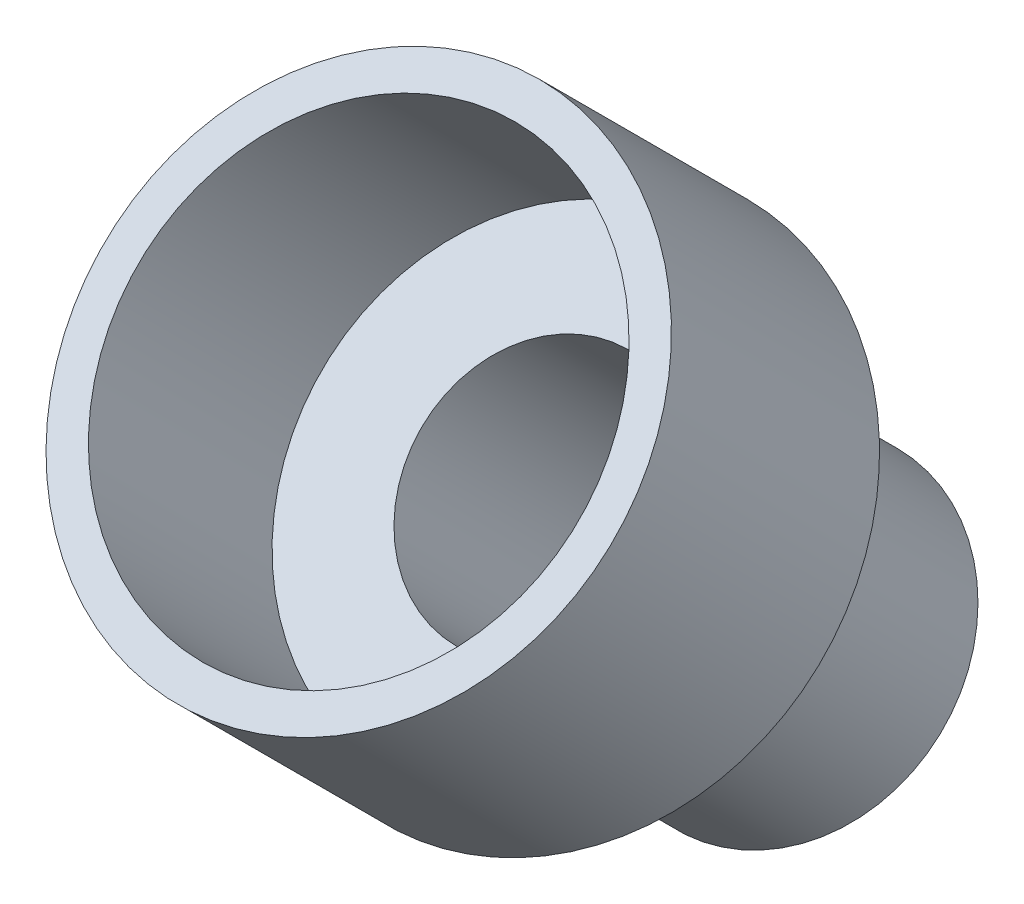
ISO-10303-21;
HEADER;
FILE_DESCRIPTION(('STEP AP214'),'2;1');
FILE_NAME('part.step','',(''),(''),'','','');
FILE_SCHEMA(('AUTOMOTIVE_DESIGN { 1 0 10303 214 1 1 1 1 }'));
ENDSEC;
DATA;
#1=APPLICATION_CONTEXT('core data for automotive mechanical design processes');
#2=APPLICATION_PROTOCOL_DEFINITION('international standard','automotive_design',2000,#1);
#3=PRODUCT_CONTEXT('',#1,'mechanical');
#4=PRODUCT('Part','Part','',(#3));
#5=PRODUCT_RELATED_PRODUCT_CATEGORY('part','',(#4));
#6=PRODUCT_DEFINITION_FORMATION('','',#4);
#7=PRODUCT_DEFINITION_CONTEXT('part definition',#1,'design');
#8=PRODUCT_DEFINITION('design','',#6,#7);
#9=PRODUCT_DEFINITION_SHAPE('','',#8);
#10=(LENGTH_UNIT() NAMED_UNIT(*) SI_UNIT(.MILLI.,.METRE.));
#11=(NAMED_UNIT(*) PLANE_ANGLE_UNIT() SI_UNIT($,.RADIAN.));
#12=(NAMED_UNIT(*) SI_UNIT($,.STERADIAN.) SOLID_ANGLE_UNIT());
#13=UNCERTAINTY_MEASURE_WITH_UNIT(LENGTH_MEASURE(1.E-05),#10,'distance_accuracy_value','');
#14=(GEOMETRIC_REPRESENTATION_CONTEXT(3) GLOBAL_UNCERTAINTY_ASSIGNED_CONTEXT((#13)) GLOBAL_UNIT_ASSIGNED_CONTEXT((#10,
#11,#12)) REPRESENTATION_CONTEXT('',''));
#15=CARTESIAN_POINT('',(0.,0.,0.));
#16=DIRECTION('',(0.,0.,1.));
#17=DIRECTION('',(1.,0.,0.));
#18=AXIS2_PLACEMENT_3D('',#15,#16,#17);
#19=CARTESIAN_POINT('',(0.,125.566457335286,51.4420183313214));
#20=DIRECTION('',(0.,-0.707106781186546,-0.707106781186549));
#21=DIRECTION('',(0.,0.707106781186549,-0.707106781186546));
#22=AXIS2_PLACEMENT_3D('',#19,#20,#21);
#23=PLANE('',#22);
#24=CARTESIAN_POINT('',(0.,134.582068795414,42.4264068711929));
#25=DIRECTION('',(0.,-0.707106781186546,-0.707106781186549));
#26=DIRECTION('',(0.,0.707106781186549,-0.707106781186546));
#27=AXIS2_PLACEMENT_3D('',#24,#25,#26);
#28=CIRCLE('',#27,14.75);
#29=CARTESIAN_POINT('',(0.,145.011893817916,31.9965818486914));
#30=VERTEX_POINT('',#29);
#31=EDGE_CURVE('E10',#30,#30,#28,.T.);
#32=ORIENTED_EDGE('',*,*,#31,.F.);
#33=EDGE_LOOP('',(#32));
#34=FACE_BOUND('',#33,.T.);
#35=CARTESIAN_POINT('',(0.,134.582068795414,42.4264068711929));
#36=DIRECTION('',(0.,-0.707106781186546,-0.707106781186549));
#37=DIRECTION('',(0.,0.707106781186549,-0.707106781186546));
#38=AXIS2_PLACEMENT_3D('',#35,#36,#37);
#39=CIRCLE('',#38,12.75);
#40=CARTESIAN_POINT('',(0.,143.597680255543,33.4107954110645));
#41=VERTEX_POINT('',#40);
#42=EDGE_CURVE('E63',#41,#41,#39,.T.);
#43=ORIENTED_EDGE('',*,*,#42,.T.);
#44=EDGE_LOOP('',(#43));
#45=FACE_BOUND('',#44,.T.);
#46=ADVANCED_FACE('F35',(#34,#45),#23,.F.);
#47=CARTESIAN_POINT('',(0.,92.1556619242215,0.));
#48=DIRECTION('',(0.,-0.707106781186546,-0.707106781186549));
#49=DIRECTION('',(0.,0.707106781186549,-0.707106781186546));
#50=AXIS2_PLACEMENT_3D('',#47,#48,#49);
#51=CYLINDRICAL_SURFACE('',#50,14.75);
#52=CARTESIAN_POINT('',(0.,122.561253515243,30.4055915910216));
#53=DIRECTION('',(0.,-0.707106781186546,-0.707106781186549));
#54=DIRECTION('',(0.,0.707106781186549,-0.707106781186546));
#55=AXIS2_PLACEMENT_3D('',#52,#53,#54);
#56=CIRCLE('',#55,14.75);
#57=CARTESIAN_POINT('',(0.,132.991078537745,19.9757665685201));
#58=VERTEX_POINT('',#57);
#59=EDGE_CURVE('E41',#58,#58,#56,.T.);
#60=ORIENTED_EDGE('',*,*,#59,.F.);
#61=EDGE_LOOP('',(#60));
#62=FACE_BOUND('',#61,.T.);
#63=ORIENTED_EDGE('',*,*,#31,.T.);
#64=EDGE_LOOP('',(#63));
#65=FACE_BOUND('',#64,.T.);
#66=ADVANCED_FACE('F100',(#62,#65),#51,.T.);
#67=CARTESIAN_POINT('',(0.,112.131428492741,40.8354166135232));
#68=DIRECTION('',(0.,0.707106781186546,0.707106781186549));
#69=DIRECTION('',(0.,-0.707106781186549,0.707106781186546));
#70=AXIS2_PLACEMENT_3D('',#67,#68,#69);
#71=PLANE('',#70);
#72=CARTESIAN_POINT('',(0.,122.561253515243,30.4055915910216));
#73=DIRECTION('',(0.,-0.707106781186546,-0.707106781186549));
#74=DIRECTION('',(0.,0.707106781186549,-0.707106781186546));
#75=AXIS2_PLACEMENT_3D('',#72,#73,#74);
#76=CIRCLE('',#75,9.);
#77=CARTESIAN_POINT('',(0.,128.925214545922,24.0416305603427));
#78=VERTEX_POINT('',#77);
#79=EDGE_CURVE('E45',#78,#78,#76,.T.);
#80=ORIENTED_EDGE('',*,*,#79,.F.);
#81=EDGE_LOOP('',(#80));
#82=FACE_BOUND('',#81,.T.);
#83=ORIENTED_EDGE('',*,*,#59,.T.);
#84=EDGE_LOOP('',(#83));
#85=FACE_BOUND('',#84,.T.);
#86=ADVANCED_FACE('F95',(#82,#85),#71,.F.);
#87=CARTESIAN_POINT('',(0.,92.1556619242215,0.));
#88=DIRECTION('',(0.,-0.707106781186546,-0.707106781186549));
#89=DIRECTION('',(0.,0.707106781186549,-0.707106781186546));
#90=AXIS2_PLACEMENT_3D('',#87,#88,#89);
#91=CYLINDRICAL_SURFACE('',#90,9.);
#92=CARTESIAN_POINT('',(0.,109.833331453885,17.6776695296637));
#93=DIRECTION('',(0.,-0.707106781186546,-0.707106781186549));
#94=DIRECTION('',(0.,0.707106781186549,-0.707106781186546));
#95=AXIS2_PLACEMENT_3D('',#92,#93,#94);
#96=CIRCLE('',#95,9.);
#97=CARTESIAN_POINT('',(0.,116.197292484564,11.3137084989848));
#98=VERTEX_POINT('',#97);
#99=EDGE_CURVE('E49',#98,#98,#96,.T.);
#100=ORIENTED_EDGE('',*,*,#99,.F.);
#101=EDGE_LOOP('',(#100));
#102=FACE_BOUND('',#101,.T.);
#103=ORIENTED_EDGE('',*,*,#79,.T.);
#104=EDGE_LOOP('',(#103));
#105=FACE_BOUND('',#104,.T.);
#106=ADVANCED_FACE('F89',(#102,#105),#91,.T.);
#107=CARTESIAN_POINT('',(0.,104.883583985579,22.6274169979695));
#108=DIRECTION('',(0.,0.707106781186546,0.707106781186549));
#109=DIRECTION('',(0.,-0.707106781186549,0.707106781186546));
#110=AXIS2_PLACEMENT_3D('',#107,#108,#109);
#111=PLANE('',#110);
#112=CARTESIAN_POINT('',(0.,109.833331453885,17.6776695296637));
#113=DIRECTION('',(0.,-0.707106781186546,-0.707106781186549));
#114=DIRECTION('',(0.,0.707106781186549,-0.707106781186546));
#115=AXIS2_PLACEMENT_3D('',#112,#113,#114);
#116=CIRCLE('',#115,7.);
#117=CARTESIAN_POINT('',(0.,114.783078922191,12.7279220613579));
#118=VERTEX_POINT('',#117);
#119=EDGE_CURVE('E54',#118,#118,#116,.T.);
#120=ORIENTED_EDGE('',*,*,#119,.F.);
#121=EDGE_LOOP('',(#120));
#122=FACE_BOUND('',#121,.T.);
#123=ORIENTED_EDGE('',*,*,#99,.T.);
#124=EDGE_LOOP('',(#123));
#125=FACE_BOUND('',#124,.T.);
#126=ADVANCED_FACE('F83',(#122,#125),#111,.F.);
#127=CARTESIAN_POINT('',(0.,92.1556619242215,0.));
#128=DIRECTION('',(0.,-0.707106781186546,-0.707106781186549));
#129=DIRECTION('',(0.,0.707106781186549,-0.707106781186546));
#130=AXIS2_PLACEMENT_3D('',#127,#128,#129);
#131=CYLINDRICAL_SURFACE('',#130,7.);
#132=CARTESIAN_POINT('',(0.,123.975467077616,31.8198051533947));
#133=DIRECTION('',(0.,-0.707106781186546,-0.707106781186549));
#134=DIRECTION('',(0.,0.707106781186549,-0.707106781186546));
#135=AXIS2_PLACEMENT_3D('',#132,#133,#134);
#136=CIRCLE('',#135,6.99999999999999);
#137=CARTESIAN_POINT('',(0.,128.925214545922,26.8700576850889));
#138=VERTEX_POINT('',#137);
#139=EDGE_CURVE('E57',#138,#138,#136,.T.);
#140=ORIENTED_EDGE('',*,*,#139,.F.);
#141=EDGE_LOOP('',(#140));
#142=FACE_BOUND('',#141,.T.);
#143=ORIENTED_EDGE('',*,*,#119,.T.);
#144=EDGE_LOOP('',(#143));
#145=FACE_BOUND('',#144,.T.);
#146=ADVANCED_FACE('F77',(#142,#145),#131,.F.);
#147=CARTESIAN_POINT('',(0.,114.959855617488,40.8354166135232));
#148=DIRECTION('',(0.,-0.707106781186546,-0.707106781186549));
#149=DIRECTION('',(0.,0.707106781186549,-0.707106781186546));
#150=AXIS2_PLACEMENT_3D('',#147,#148,#149);
#151=PLANE('',#150);
#152=CARTESIAN_POINT('',(0.,123.975467077616,31.8198051533947));
#153=DIRECTION('',(0.,-0.707106781186546,-0.707106781186549));
#154=DIRECTION('',(0.,0.707106781186549,-0.707106781186546));
#155=AXIS2_PLACEMENT_3D('',#152,#153,#154);
#156=CIRCLE('',#155,12.75);
#157=CARTESIAN_POINT('',(0.,132.991078537745,22.8041936932663));
#158=VERTEX_POINT('',#157);
#159=EDGE_CURVE('E60',#158,#158,#156,.T.);
#160=ORIENTED_EDGE('',*,*,#159,.F.);
#161=EDGE_LOOP('',(#160));
#162=FACE_BOUND('',#161,.T.);
#163=ORIENTED_EDGE('',*,*,#139,.T.);
#164=EDGE_LOOP('',(#163));
#165=FACE_BOUND('',#164,.T.);
#166=ADVANCED_FACE('F71',(#162,#165),#151,.F.);
#167=CARTESIAN_POINT('',(0.,92.1556619242215,0.));
#168=DIRECTION('',(0.,-0.707106781186546,-0.707106781186549));
#169=DIRECTION('',(0.,0.707106781186549,-0.707106781186546));
#170=AXIS2_PLACEMENT_3D('',#167,#168,#169);
#171=CYLINDRICAL_SURFACE('',#170,12.75);
#172=ORIENTED_EDGE('',*,*,#42,.F.);
#173=EDGE_LOOP('',(#172));
#174=FACE_BOUND('',#173,.T.);
#175=ORIENTED_EDGE('',*,*,#159,.T.);
#176=EDGE_LOOP('',(#175));
#177=FACE_BOUND('',#176,.T.);
#178=ADVANCED_FACE('F68',(#174,#177),#171,.F.);
#179=CLOSED_SHELL('',(#46,#66,#86,#106,#126,#146,#166,#178));
#180=MANIFOLD_SOLID_BREP('B2',#179);
#181=ADVANCED_BREP_SHAPE_REPRESENTATION('',(#18,#180),#14);
#182=SHAPE_DEFINITION_REPRESENTATION(#9,#181);
ENDSEC;
END-ISO-10303-21;
